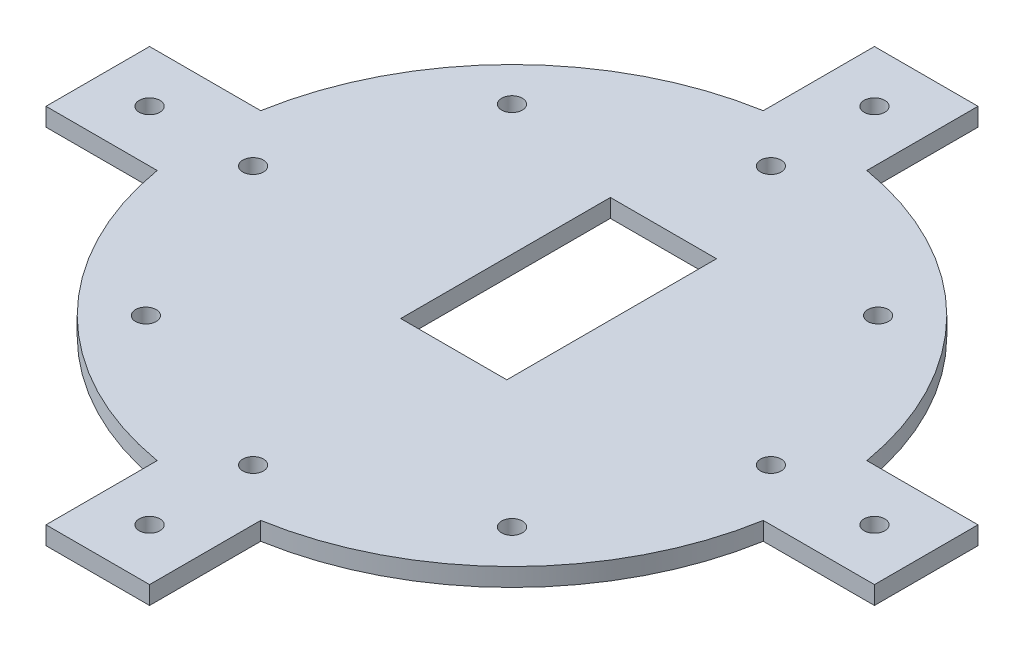
ISO-10303-21;
HEADER;
FILE_DESCRIPTION(('STEP AP214'),'2;1');
FILE_NAME('part.step','',(''),(''),'','','');
FILE_SCHEMA(('AUTOMOTIVE_DESIGN { 1 0 10303 214 1 1 1 1 }'));
ENDSEC;
DATA;
#1=APPLICATION_CONTEXT('core data for automotive mechanical design processes');
#2=APPLICATION_PROTOCOL_DEFINITION('international standard','automotive_design',2000,#1);
#3=PRODUCT_CONTEXT('',#1,'mechanical');
#4=PRODUCT('Part','Part','',(#3));
#5=PRODUCT_RELATED_PRODUCT_CATEGORY('part','',(#4));
#6=PRODUCT_DEFINITION_FORMATION('','',#4);
#7=PRODUCT_DEFINITION_CONTEXT('part definition',#1,'design');
#8=PRODUCT_DEFINITION('design','',#6,#7);
#9=PRODUCT_DEFINITION_SHAPE('','',#8);
#10=(LENGTH_UNIT() NAMED_UNIT(*) SI_UNIT(.MILLI.,.METRE.));
#11=(NAMED_UNIT(*) PLANE_ANGLE_UNIT() SI_UNIT($,.RADIAN.));
#12=(NAMED_UNIT(*) SI_UNIT($,.STERADIAN.) SOLID_ANGLE_UNIT());
#13=UNCERTAINTY_MEASURE_WITH_UNIT(LENGTH_MEASURE(1.E-05),#10,'distance_accuracy_value','');
#14=(GEOMETRIC_REPRESENTATION_CONTEXT(3) GLOBAL_UNCERTAINTY_ASSIGNED_CONTEXT((#13)) GLOBAL_UNIT_ASSIGNED_CONTEXT((#10,
#11,#12)) REPRESENTATION_CONTEXT('',''));
#15=CARTESIAN_POINT('',(0.,0.,0.));
#16=DIRECTION('',(0.,0.,1.));
#17=DIRECTION('',(1.,0.,0.));
#18=AXIS2_PLACEMENT_3D('',#15,#16,#17);
#19=CARTESIAN_POINT('',(-10.,3.5,-80.));
#20=DIRECTION('',(1.,0.,0.));
#21=DIRECTION('',(0.,0.,-1.));
#22=AXIS2_PLACEMENT_3D('',#19,#20,#21);
#23=PLANE('',#22);
#24=DIRECTION('',(0.,0.,1.));
#25=VECTOR('',#24,1.);
#26=CARTESIAN_POINT('',(-10.,0.,-80.));
#27=LINE('',#26,#25);
#28=CARTESIAN_POINT('',(-10.,0.,-80.));
#29=VERTEX_POINT('',#28);
#30=CARTESIAN_POINT('',(-9.99999999999997,0.,-58.5304135246494));
#31=VERTEX_POINT('',#30);
#32=EDGE_CURVE('E290',#29,#31,#27,.T.);
#33=ORIENTED_EDGE('',*,*,#32,.T.);
#34=DIRECTION('',(0.,-1.,0.));
#35=VECTOR('',#34,1.);
#36=CARTESIAN_POINT('',(-9.99999999999997,3.5,-58.5304135246494));
#37=LINE('',#36,#35);
#38=CARTESIAN_POINT('',(-9.99999999999997,3.5,-58.5304135246494));
#39=VERTEX_POINT('',#38);
#40=EDGE_CURVE('E11',#39,#31,#37,.T.);
#41=ORIENTED_EDGE('',*,*,#40,.F.);
#42=DIRECTION('',(0.,0.,1.));
#43=VECTOR('',#42,1.);
#44=CARTESIAN_POINT('',(-10.,3.5,-80.));
#45=LINE('',#44,#43);
#46=CARTESIAN_POINT('',(-10.,3.5,-80.));
#47=VERTEX_POINT('',#46);
#48=EDGE_CURVE('E291',#47,#39,#45,.T.);
#49=ORIENTED_EDGE('',*,*,#48,.F.);
#50=DIRECTION('',(0.,-1.,0.));
#51=VECTOR('',#50,1.);
#52=CARTESIAN_POINT('',(-10.,3.5,-80.));
#53=LINE('',#52,#51);
#54=EDGE_CURVE('E347',#47,#29,#53,.T.);
#55=ORIENTED_EDGE('',*,*,#54,.T.);
#56=EDGE_LOOP('',(#33,#41,#49,#55));
#57=FACE_BOUND('',#56,.T.);
#58=ADVANCED_FACE('F42',(#57),#23,.F.);
#59=CARTESIAN_POINT('',(0.,3.5,0.));
#60=DIRECTION('',(0.,-1.,0.));
#61=DIRECTION('',(0.,0.,-1.));
#62=AXIS2_PLACEMENT_3D('',#59,#60,#61);
#63=CYLINDRICAL_SURFACE('',#62,59.3785256415689);
#64=CARTESIAN_POINT('',(0.,0.,0.));
#65=DIRECTION('',(0.,1.,0.));
#66=DIRECTION('',(0.,0.,1.));
#67=AXIS2_PLACEMENT_3D('',#64,#65,#66);
#68=CIRCLE('',#67,59.3785256415689);
#69=CARTESIAN_POINT('',(-58.5304135246494,0.,-10.));
#70=VERTEX_POINT('',#69);
#71=EDGE_CURVE('E351',#31,#70,#68,.T.);
#72=ORIENTED_EDGE('',*,*,#71,.T.);
#73=DIRECTION('',(0.,-1.,0.));
#74=VECTOR('',#73,1.);
#75=CARTESIAN_POINT('',(-58.5304135246494,3.5,-10.));
#76=LINE('',#75,#74);
#77=CARTESIAN_POINT('',(-58.5304135246494,3.5,-10.));
#78=VERTEX_POINT('',#77);
#79=EDGE_CURVE('E50',#78,#70,#76,.T.);
#80=ORIENTED_EDGE('',*,*,#79,.F.);
#81=CARTESIAN_POINT('',(0.,3.5,0.));
#82=DIRECTION('',(0.,1.,0.));
#83=DIRECTION('',(0.,0.,1.));
#84=AXIS2_PLACEMENT_3D('',#81,#82,#83);
#85=CIRCLE('',#84,59.3785256415689);
#86=EDGE_CURVE('E295',#39,#78,#85,.T.);
#87=ORIENTED_EDGE('',*,*,#86,.F.);
#88=ORIENTED_EDGE('',*,*,#40,.T.);
#89=EDGE_LOOP('',(#72,#80,#87,#88));
#90=FACE_BOUND('',#89,.T.);
#91=ADVANCED_FACE('F457',(#90),#63,.T.);
#92=CARTESIAN_POINT('',(-80.,3.5,-10.));
#93=DIRECTION('',(0.,0.,-1.));
#94=DIRECTION('',(-1.,0.,0.));
#95=AXIS2_PLACEMENT_3D('',#92,#93,#94);
#96=PLANE('',#95);
#97=DIRECTION('',(1.,0.,0.));
#98=VECTOR('',#97,1.);
#99=CARTESIAN_POINT('',(-80.,0.,-10.));
#100=LINE('',#99,#98);
#101=CARTESIAN_POINT('',(-80.,0.,-10.));
#102=VERTEX_POINT('',#101);
#103=EDGE_CURVE('E355',#102,#70,#100,.T.);
#104=ORIENTED_EDGE('',*,*,#103,.F.);
#105=DIRECTION('',(0.,-1.,0.));
#106=VECTOR('',#105,1.);
#107=CARTESIAN_POINT('',(-80.,3.5,-10.));
#108=LINE('',#107,#106);
#109=CARTESIAN_POINT('',(-80.,3.5,-10.));
#110=VERTEX_POINT('',#109);
#111=EDGE_CURVE('E448',#110,#102,#108,.T.);
#112=ORIENTED_EDGE('',*,*,#111,.F.);
#113=DIRECTION('',(1.,0.,0.));
#114=VECTOR('',#113,1.);
#115=CARTESIAN_POINT('',(-80.,3.5,-10.));
#116=LINE('',#115,#114);
#117=EDGE_CURVE('E299',#110,#78,#116,.T.);
#118=ORIENTED_EDGE('',*,*,#117,.T.);
#119=ORIENTED_EDGE('',*,*,#79,.T.);
#120=EDGE_LOOP('',(#104,#112,#118,#119));
#121=FACE_BOUND('',#120,.T.);
#122=ADVANCED_FACE('F454',(#121),#96,.T.);
#123=CARTESIAN_POINT('',(-80.,3.5,10.));
#124=DIRECTION('',(-1.,0.,0.));
#125=DIRECTION('',(0.,0.,1.));
#126=AXIS2_PLACEMENT_3D('',#123,#124,#125);
#127=PLANE('',#126);
#128=DIRECTION('',(0.,0.,-1.));
#129=VECTOR('',#128,1.);
#130=CARTESIAN_POINT('',(-80.,0.,10.));
#131=LINE('',#130,#129);
#132=CARTESIAN_POINT('',(-80.,0.,10.));
#133=VERTEX_POINT('',#132);
#134=EDGE_CURVE('E359',#133,#102,#131,.T.);
#135=ORIENTED_EDGE('',*,*,#134,.F.);
#136=DIRECTION('',(0.,-1.,0.));
#137=VECTOR('',#136,1.);
#138=CARTESIAN_POINT('',(-80.,3.5,10.));
#139=LINE('',#138,#137);
#140=CARTESIAN_POINT('',(-80.,3.5,10.));
#141=VERTEX_POINT('',#140);
#142=EDGE_CURVE('E445',#141,#133,#139,.T.);
#143=ORIENTED_EDGE('',*,*,#142,.F.);
#144=DIRECTION('',(0.,0.,-1.));
#145=VECTOR('',#144,1.);
#146=CARTESIAN_POINT('',(-80.,3.5,10.));
#147=LINE('',#146,#145);
#148=EDGE_CURVE('E303',#141,#110,#147,.T.);
#149=ORIENTED_EDGE('',*,*,#148,.T.);
#150=ORIENTED_EDGE('',*,*,#111,.T.);
#151=EDGE_LOOP('',(#135,#143,#149,#150));
#152=FACE_BOUND('',#151,.T.);
#153=ADVANCED_FACE('F465',(#152),#127,.T.);
#154=CARTESIAN_POINT('',(-80.,3.5,10.));
#155=DIRECTION('',(0.,0.,-1.));
#156=DIRECTION('',(-1.,0.,0.));
#157=AXIS2_PLACEMENT_3D('',#154,#155,#156);
#158=PLANE('',#157);
#159=DIRECTION('',(1.,0.,0.));
#160=VECTOR('',#159,1.);
#161=CARTESIAN_POINT('',(-80.,0.,10.));
#162=LINE('',#161,#160);
#163=CARTESIAN_POINT('',(-58.5304135246494,0.,10.));
#164=VERTEX_POINT('',#163);
#165=EDGE_CURVE('E363',#133,#164,#162,.T.);
#166=ORIENTED_EDGE('',*,*,#165,.T.);
#167=DIRECTION('',(0.,-1.,0.));
#168=VECTOR('',#167,1.);
#169=CARTESIAN_POINT('',(-58.5304135246494,3.5,10.));
#170=LINE('',#169,#168);
#171=CARTESIAN_POINT('',(-58.5304135246494,3.5,10.));
#172=VERTEX_POINT('',#171);
#173=EDGE_CURVE('E441',#172,#164,#170,.T.);
#174=ORIENTED_EDGE('',*,*,#173,.F.);
#175=DIRECTION('',(1.,0.,0.));
#176=VECTOR('',#175,1.);
#177=CARTESIAN_POINT('',(-80.,3.5,10.));
#178=LINE('',#177,#176);
#179=EDGE_CURVE('E307',#141,#172,#178,.T.);
#180=ORIENTED_EDGE('',*,*,#179,.F.);
#181=ORIENTED_EDGE('',*,*,#142,.T.);
#182=EDGE_LOOP('',(#166,#174,#180,#181));
#183=FACE_BOUND('',#182,.T.);
#184=ADVANCED_FACE('F523',(#183),#158,.F.);
#185=CARTESIAN_POINT('',(0.,3.5,0.));
#186=DIRECTION('',(0.,-1.,0.));
#187=DIRECTION('',(0.,0.,-1.));
#188=AXIS2_PLACEMENT_3D('',#185,#186,#187);
#189=CYLINDRICAL_SURFACE('',#188,59.3785256415689);
#190=CARTESIAN_POINT('',(0.,0.,0.));
#191=DIRECTION('',(0.,1.,0.));
#192=DIRECTION('',(0.,0.,1.));
#193=AXIS2_PLACEMENT_3D('',#190,#191,#192);
#194=CIRCLE('',#193,59.3785256415689);
#195=CARTESIAN_POINT('',(-10.,0.,58.5304135246494));
#196=VERTEX_POINT('',#195);
#197=EDGE_CURVE('E366',#164,#196,#194,.T.);
#198=ORIENTED_EDGE('',*,*,#197,.T.);
#199=DIRECTION('',(0.,-1.,0.));
#200=VECTOR('',#199,1.);
#201=CARTESIAN_POINT('',(-10.,3.5,58.5304135246494));
#202=LINE('',#201,#200);
#203=CARTESIAN_POINT('',(-10.,3.5,58.5304135246494));
#204=VERTEX_POINT('',#203);
#205=EDGE_CURVE('E437',#204,#196,#202,.T.);
#206=ORIENTED_EDGE('',*,*,#205,.F.);
#207=CARTESIAN_POINT('',(0.,3.5,0.));
#208=DIRECTION('',(0.,1.,0.));
#209=DIRECTION('',(0.,0.,1.));
#210=AXIS2_PLACEMENT_3D('',#207,#208,#209);
#211=CIRCLE('',#210,59.3785256415689);
#212=EDGE_CURVE('E310',#172,#204,#211,.T.);
#213=ORIENTED_EDGE('',*,*,#212,.F.);
#214=ORIENTED_EDGE('',*,*,#173,.T.);
#215=EDGE_LOOP('',(#198,#206,#213,#214));
#216=FACE_BOUND('',#215,.T.);
#217=ADVANCED_FACE('F520',(#216),#189,.T.);
#218=CARTESIAN_POINT('',(-9.99999999999999,3.5,58.5304135246494));
#219=DIRECTION('',(1.,0.,0.));
#220=DIRECTION('',(0.,0.,-1.));
#221=AXIS2_PLACEMENT_3D('',#218,#219,#220);
#222=PLANE('',#221);
#223=DIRECTION('',(0.,0.,1.));
#224=VECTOR('',#223,1.);
#225=CARTESIAN_POINT('',(-9.99999999999999,0.,58.5304135246494));
#226=LINE('',#225,#224);
#227=CARTESIAN_POINT('',(-9.99999999999999,0.,80.));
#228=VERTEX_POINT('',#227);
#229=EDGE_CURVE('E369',#196,#228,#226,.T.);
#230=ORIENTED_EDGE('',*,*,#229,.T.);
#231=DIRECTION('',(0.,-1.,0.));
#232=VECTOR('',#231,1.);
#233=CARTESIAN_POINT('',(-9.99999999999999,3.5,80.));
#234=LINE('',#233,#232);
#235=CARTESIAN_POINT('',(-9.99999999999999,3.5,80.));
#236=VERTEX_POINT('',#235);
#237=EDGE_CURVE('E433',#236,#228,#234,.T.);
#238=ORIENTED_EDGE('',*,*,#237,.F.);
#239=DIRECTION('',(0.,0.,1.));
#240=VECTOR('',#239,1.);
#241=CARTESIAN_POINT('',(-9.99999999999999,3.5,58.5304135246494));
#242=LINE('',#241,#240);
#243=EDGE_CURVE('E313',#204,#236,#242,.T.);
#244=ORIENTED_EDGE('',*,*,#243,.F.);
#245=ORIENTED_EDGE('',*,*,#205,.T.);
#246=EDGE_LOOP('',(#230,#238,#244,#245));
#247=FACE_BOUND('',#246,.T.);
#248=ADVANCED_FACE('F516',(#247),#222,.F.);
#249=CARTESIAN_POINT('',(-9.99999999999999,3.5,80.));
#250=DIRECTION('',(0.,0.,-1.));
#251=DIRECTION('',(-1.,0.,0.));
#252=AXIS2_PLACEMENT_3D('',#249,#250,#251);
#253=PLANE('',#252);
#254=DIRECTION('',(1.,0.,0.));
#255=VECTOR('',#254,1.);
#256=CARTESIAN_POINT('',(-9.99999999999999,0.,80.));
#257=LINE('',#256,#255);
#258=CARTESIAN_POINT('',(10.,0.,80.));
#259=VERTEX_POINT('',#258);
#260=EDGE_CURVE('E372',#228,#259,#257,.T.);
#261=ORIENTED_EDGE('',*,*,#260,.T.);
#262=DIRECTION('',(0.,-1.,0.));
#263=VECTOR('',#262,1.);
#264=CARTESIAN_POINT('',(10.,3.5,80.));
#265=LINE('',#264,#263);
#266=CARTESIAN_POINT('',(10.,3.5,80.));
#267=VERTEX_POINT('',#266);
#268=EDGE_CURVE('E430',#267,#259,#265,.T.);
#269=ORIENTED_EDGE('',*,*,#268,.F.);
#270=DIRECTION('',(1.,0.,0.));
#271=VECTOR('',#270,1.);
#272=CARTESIAN_POINT('',(-9.99999999999999,3.5,80.));
#273=LINE('',#272,#271);
#274=EDGE_CURVE('E316',#236,#267,#273,.T.);
#275=ORIENTED_EDGE('',*,*,#274,.F.);
#276=ORIENTED_EDGE('',*,*,#237,.T.);
#277=EDGE_LOOP('',(#261,#269,#275,#276));
#278=FACE_BOUND('',#277,.T.);
#279=ADVANCED_FACE('F511',(#278),#253,.F.);
#280=CARTESIAN_POINT('',(10.,3.5,58.5304135246494));
#281=DIRECTION('',(1.,0.,0.));
#282=DIRECTION('',(0.,0.,-1.));
#283=AXIS2_PLACEMENT_3D('',#280,#281,#282);
#284=PLANE('',#283);
#285=DIRECTION('',(0.,0.,1.));
#286=VECTOR('',#285,1.);
#287=CARTESIAN_POINT('',(10.,0.,58.5304135246494));
#288=LINE('',#287,#286);
#289=CARTESIAN_POINT('',(10.,0.,58.5304135246494));
#290=VERTEX_POINT('',#289);
#291=EDGE_CURVE('E376',#290,#259,#288,.T.);
#292=ORIENTED_EDGE('',*,*,#291,.F.);
#293=DIRECTION('',(0.,-1.,0.));
#294=VECTOR('',#293,1.);
#295=CARTESIAN_POINT('',(10.,3.5,58.5304135246494));
#296=LINE('',#295,#294);
#297=CARTESIAN_POINT('',(10.,3.5,58.5304135246494));
#298=VERTEX_POINT('',#297);
#299=EDGE_CURVE('E427',#298,#290,#296,.T.);
#300=ORIENTED_EDGE('',*,*,#299,.F.);
#301=DIRECTION('',(0.,0.,1.));
#302=VECTOR('',#301,1.);
#303=CARTESIAN_POINT('',(10.,3.5,58.5304135246494));
#304=LINE('',#303,#302);
#305=EDGE_CURVE('E319',#298,#267,#304,.T.);
#306=ORIENTED_EDGE('',*,*,#305,.T.);
#307=ORIENTED_EDGE('',*,*,#268,.T.);
#308=EDGE_LOOP('',(#292,#300,#306,#307));
#309=FACE_BOUND('',#308,.T.);
#310=ADVANCED_FACE('F506',(#309),#284,.T.);
#311=CARTESIAN_POINT('',(0.,3.5,0.));
#312=DIRECTION('',(0.,-1.,0.));
#313=DIRECTION('',(0.,0.,-1.));
#314=AXIS2_PLACEMENT_3D('',#311,#312,#313);
#315=CYLINDRICAL_SURFACE('',#314,59.3785256415689);
#316=CARTESIAN_POINT('',(0.,0.,0.));
#317=DIRECTION('',(0.,1.,0.));
#318=DIRECTION('',(0.,0.,1.));
#319=AXIS2_PLACEMENT_3D('',#316,#317,#318);
#320=CIRCLE('',#319,59.3785256415689);
#321=CARTESIAN_POINT('',(58.5304135246494,0.,10.));
#322=VERTEX_POINT('',#321);
#323=EDGE_CURVE('E380',#290,#322,#320,.T.);
#324=ORIENTED_EDGE('',*,*,#323,.T.);
#325=DIRECTION('',(0.,-1.,0.));
#326=VECTOR('',#325,1.);
#327=CARTESIAN_POINT('',(58.5304135246494,3.5,10.));
#328=LINE('',#327,#326);
#329=CARTESIAN_POINT('',(58.5304135246494,3.5,10.));
#330=VERTEX_POINT('',#329);
#331=EDGE_CURVE('E423',#330,#322,#328,.T.);
#332=ORIENTED_EDGE('',*,*,#331,.F.);
#333=CARTESIAN_POINT('',(0.,3.5,0.));
#334=DIRECTION('',(0.,1.,0.));
#335=DIRECTION('',(0.,0.,1.));
#336=AXIS2_PLACEMENT_3D('',#333,#334,#335);
#337=CIRCLE('',#336,59.3785256415689);
#338=EDGE_CURVE('E323',#298,#330,#337,.T.);
#339=ORIENTED_EDGE('',*,*,#338,.F.);
#340=ORIENTED_EDGE('',*,*,#299,.T.);
#341=EDGE_LOOP('',(#324,#332,#339,#340));
#342=FACE_BOUND('',#341,.T.);
#343=ADVANCED_FACE('F503',(#342),#315,.T.);
#344=CARTESIAN_POINT('',(58.5304135246494,3.5,10.));
#345=DIRECTION('',(0.,0.,-1.));
#346=DIRECTION('',(-1.,0.,0.));
#347=AXIS2_PLACEMENT_3D('',#344,#345,#346);
#348=PLANE('',#347);
#349=DIRECTION('',(1.,0.,0.));
#350=VECTOR('',#349,1.);
#351=CARTESIAN_POINT('',(58.5304135246494,0.,10.));
#352=LINE('',#351,#350);
#353=CARTESIAN_POINT('',(80.,0.,10.));
#354=VERTEX_POINT('',#353);
#355=EDGE_CURVE('E383',#322,#354,#352,.T.);
#356=ORIENTED_EDGE('',*,*,#355,.T.);
#357=DIRECTION('',(0.,-1.,0.));
#358=VECTOR('',#357,1.);
#359=CARTESIAN_POINT('',(80.,3.5,10.));
#360=LINE('',#359,#358);
#361=CARTESIAN_POINT('',(80.,3.5,10.));
#362=VERTEX_POINT('',#361);
#363=EDGE_CURVE('E419',#362,#354,#360,.T.);
#364=ORIENTED_EDGE('',*,*,#363,.F.);
#365=DIRECTION('',(1.,0.,0.));
#366=VECTOR('',#365,1.);
#367=CARTESIAN_POINT('',(58.5304135246494,3.5,10.));
#368=LINE('',#367,#366);
#369=EDGE_CURVE('E326',#330,#362,#368,.T.);
#370=ORIENTED_EDGE('',*,*,#369,.F.);
#371=ORIENTED_EDGE('',*,*,#331,.T.);
#372=EDGE_LOOP('',(#356,#364,#370,#371));
#373=FACE_BOUND('',#372,.T.);
#374=ADVANCED_FACE('F498',(#373),#348,.F.);
#375=CARTESIAN_POINT('',(80.,3.5,10.));
#376=DIRECTION('',(-1.,0.,0.));
#377=DIRECTION('',(0.,0.,1.));
#378=AXIS2_PLACEMENT_3D('',#375,#376,#377);
#379=PLANE('',#378);
#380=DIRECTION('',(0.,0.,-1.));
#381=VECTOR('',#380,1.);
#382=CARTESIAN_POINT('',(80.,0.,10.));
#383=LINE('',#382,#381);
#384=CARTESIAN_POINT('',(80.,0.,-10.));
#385=VERTEX_POINT('',#384);
#386=EDGE_CURVE('E386',#354,#385,#383,.T.);
#387=ORIENTED_EDGE('',*,*,#386,.T.);
#388=DIRECTION('',(0.,-1.,0.));
#389=VECTOR('',#388,1.);
#390=CARTESIAN_POINT('',(80.,3.5,-10.));
#391=LINE('',#390,#389);
#392=CARTESIAN_POINT('',(80.,3.5,-10.));
#393=VERTEX_POINT('',#392);
#394=EDGE_CURVE('E416',#393,#385,#391,.T.);
#395=ORIENTED_EDGE('',*,*,#394,.F.);
#396=DIRECTION('',(0.,0.,-1.));
#397=VECTOR('',#396,1.);
#398=CARTESIAN_POINT('',(80.,3.5,10.));
#399=LINE('',#398,#397);
#400=EDGE_CURVE('E329',#362,#393,#399,.T.);
#401=ORIENTED_EDGE('',*,*,#400,.F.);
#402=ORIENTED_EDGE('',*,*,#363,.T.);
#403=EDGE_LOOP('',(#387,#395,#401,#402));
#404=FACE_BOUND('',#403,.T.);
#405=ADVANCED_FACE('F492',(#404),#379,.F.);
#406=CARTESIAN_POINT('',(58.5304135246494,3.5,-10.));
#407=DIRECTION('',(0.,0.,-1.));
#408=DIRECTION('',(-1.,0.,0.));
#409=AXIS2_PLACEMENT_3D('',#406,#407,#408);
#410=PLANE('',#409);
#411=DIRECTION('',(1.,0.,0.));
#412=VECTOR('',#411,1.);
#413=CARTESIAN_POINT('',(58.5304135246494,0.,-10.));
#414=LINE('',#413,#412);
#415=CARTESIAN_POINT('',(58.5304135246494,0.,-10.));
#416=VERTEX_POINT('',#415);
#417=EDGE_CURVE('E390',#416,#385,#414,.T.);
#418=ORIENTED_EDGE('',*,*,#417,.F.);
#419=DIRECTION('',(0.,-1.,0.));
#420=VECTOR('',#419,1.);
#421=CARTESIAN_POINT('',(58.5304135246494,3.5,-10.));
#422=LINE('',#421,#420);
#423=CARTESIAN_POINT('',(58.5304135246494,3.5,-10.));
#424=VERTEX_POINT('',#423);
#425=EDGE_CURVE('E413',#424,#416,#422,.T.);
#426=ORIENTED_EDGE('',*,*,#425,.F.);
#427=DIRECTION('',(1.,0.,0.));
#428=VECTOR('',#427,1.);
#429=CARTESIAN_POINT('',(58.5304135246494,3.5,-10.));
#430=LINE('',#429,#428);
#431=EDGE_CURVE('E332',#424,#393,#430,.T.);
#432=ORIENTED_EDGE('',*,*,#431,.T.);
#433=ORIENTED_EDGE('',*,*,#394,.T.);
#434=EDGE_LOOP('',(#418,#426,#432,#433));
#435=FACE_BOUND('',#434,.T.);
#436=ADVANCED_FACE('F486',(#435),#410,.T.);
#437=CARTESIAN_POINT('',(0.,3.5,0.));
#438=DIRECTION('',(0.,-1.,0.));
#439=DIRECTION('',(0.,0.,-1.));
#440=AXIS2_PLACEMENT_3D('',#437,#438,#439);
#441=CYLINDRICAL_SURFACE('',#440,59.3785256415689);
#442=CARTESIAN_POINT('',(0.,0.,0.));
#443=DIRECTION('',(0.,1.,0.));
#444=DIRECTION('',(0.,0.,1.));
#445=AXIS2_PLACEMENT_3D('',#442,#443,#444);
#446=CIRCLE('',#445,59.3785256415689);
#447=CARTESIAN_POINT('',(10.,0.,-58.5304135246494));
#448=VERTEX_POINT('',#447);
#449=EDGE_CURVE('E394',#416,#448,#446,.T.);
#450=ORIENTED_EDGE('',*,*,#449,.T.);
#451=DIRECTION('',(0.,-1.,0.));
#452=VECTOR('',#451,1.);
#453=CARTESIAN_POINT('',(10.,3.5,-58.5304135246494));
#454=LINE('',#453,#452);
#455=CARTESIAN_POINT('',(10.,3.5,-58.5304135246494));
#456=VERTEX_POINT('',#455);
#457=EDGE_CURVE('E410',#456,#448,#454,.T.);
#458=ORIENTED_EDGE('',*,*,#457,.F.);
#459=CARTESIAN_POINT('',(0.,3.5,0.));
#460=DIRECTION('',(0.,1.,0.));
#461=DIRECTION('',(0.,0.,1.));
#462=AXIS2_PLACEMENT_3D('',#459,#460,#461);
#463=CIRCLE('',#462,59.3785256415689);
#464=EDGE_CURVE('E336',#424,#456,#463,.T.);
#465=ORIENTED_EDGE('',*,*,#464,.F.);
#466=ORIENTED_EDGE('',*,*,#425,.T.);
#467=EDGE_LOOP('',(#450,#458,#465,#466));
#468=FACE_BOUND('',#467,.T.);
#469=ADVANCED_FACE('F524',(#468),#441,.T.);
#470=CARTESIAN_POINT('',(9.99999999999999,3.5,-80.));
#471=DIRECTION('',(1.,0.,0.));
#472=DIRECTION('',(0.,0.,-1.));
#473=AXIS2_PLACEMENT_3D('',#470,#471,#472);
#474=PLANE('',#473);
#475=DIRECTION('',(0.,0.,1.));
#476=VECTOR('',#475,1.);
#477=CARTESIAN_POINT('',(9.99999999999999,0.,-80.));
#478=LINE('',#477,#476);
#479=CARTESIAN_POINT('',(9.99999999999999,0.,-80.));
#480=VERTEX_POINT('',#479);
#481=EDGE_CURVE('E398',#480,#448,#478,.T.);
#482=ORIENTED_EDGE('',*,*,#481,.F.);
#483=DIRECTION('',(0.,-1.,0.));
#484=VECTOR('',#483,1.);
#485=CARTESIAN_POINT('',(9.99999999999999,3.5,-80.));
#486=LINE('',#485,#484);
#487=CARTESIAN_POINT('',(9.99999999999999,3.5,-80.));
#488=VERTEX_POINT('',#487);
#489=EDGE_CURVE('E407',#488,#480,#486,.T.);
#490=ORIENTED_EDGE('',*,*,#489,.F.);
#491=DIRECTION('',(0.,0.,1.));
#492=VECTOR('',#491,1.);
#493=CARTESIAN_POINT('',(9.99999999999999,3.5,-80.));
#494=LINE('',#493,#492);
#495=EDGE_CURVE('E339',#488,#456,#494,.T.);
#496=ORIENTED_EDGE('',*,*,#495,.T.);
#497=ORIENTED_EDGE('',*,*,#457,.T.);
#498=EDGE_LOOP('',(#482,#490,#496,#497));
#499=FACE_BOUND('',#498,.T.);
#500=ADVANCED_FACE('F479',(#499),#474,.T.);
#501=CARTESIAN_POINT('',(-10.,3.5,-80.));
#502=DIRECTION('',(0.,0.,-1.));
#503=DIRECTION('',(-1.,0.,0.));
#504=AXIS2_PLACEMENT_3D('',#501,#502,#503);
#505=PLANE('',#504);
#506=DIRECTION('',(1.,0.,0.));
#507=VECTOR('',#506,1.);
#508=CARTESIAN_POINT('',(-10.,0.,-80.));
#509=LINE('',#508,#507);
#510=EDGE_CURVE('E296',#29,#480,#509,.T.);
#511=ORIENTED_EDGE('',*,*,#510,.F.);
#512=ORIENTED_EDGE('',*,*,#54,.F.);
#513=DIRECTION('',(1.,0.,0.));
#514=VECTOR('',#513,1.);
#515=CARTESIAN_POINT('',(-10.,3.5,-80.));
#516=LINE('',#515,#514);
#517=EDGE_CURVE('E343',#47,#488,#516,.T.);
#518=ORIENTED_EDGE('',*,*,#517,.T.);
#519=ORIENTED_EDGE('',*,*,#489,.T.);
#520=EDGE_LOOP('',(#511,#512,#518,#519));
#521=FACE_BOUND('',#520,.T.);
#522=ADVANCED_FACE('F476',(#521),#505,.T.);
#523=CARTESIAN_POINT('',(0.,3.5,0.));
#524=DIRECTION('',(0.,1.,0.));
#525=DIRECTION('',(0.,0.,1.));
#526=AXIS2_PLACEMENT_3D('',#523,#524,#525);
#527=PLANE('',#526);
#528=CARTESIAN_POINT('',(0.,3.5,-70.));
#529=DIRECTION('',(0.,1.,0.));
#530=DIRECTION('',(0.,0.,1.));
#531=AXIS2_PLACEMENT_3D('',#528,#529,#530);
#532=CIRCLE('',#531,2.00000000000334);
#533=CARTESIAN_POINT('',(0.,3.5,-67.9999999999967));
#534=VERTEX_POINT('',#533);
#535=EDGE_CURVE('E895',#534,#534,#532,.T.);
#536=ORIENTED_EDGE('',*,*,#535,.F.);
#537=EDGE_LOOP('',(#536));
#538=FACE_BOUND('',#537,.T.);
#539=CARTESIAN_POINT('',(70.0000000000015,3.5,-1.55400916767862E-12));
#540=DIRECTION('',(0.,1.,0.));
#541=DIRECTION('',(0.,0.,1.));
#542=AXIS2_PLACEMENT_3D('',#539,#540,#541);
#543=CIRCLE('',#542,2.00000000000333);
#544=CARTESIAN_POINT('',(70.0000000000015,3.5,2.00000000000178));
#545=VERTEX_POINT('',#544);
#546=EDGE_CURVE('E903',#545,#545,#543,.T.);
#547=ORIENTED_EDGE('',*,*,#546,.F.);
#548=EDGE_LOOP('',(#547));
#549=FACE_BOUND('',#548,.T.);
#550=CARTESIAN_POINT('',(3.10801833535723E-12,3.5,70.));
#551=DIRECTION('',(0.,1.,0.));
#552=DIRECTION('',(0.,0.,1.));
#553=AXIS2_PLACEMENT_3D('',#550,#551,#552);
#554=CIRCLE('',#553,2.00000000000334);
#555=CARTESIAN_POINT('',(3.10801833535723E-12,3.5,72.0000000000033));
#556=VERTEX_POINT('',#555);
#557=EDGE_CURVE('E910',#556,#556,#554,.T.);
#558=ORIENTED_EDGE('',*,*,#557,.F.);
#559=EDGE_LOOP('',(#558));
#560=FACE_BOUND('',#559,.T.);
#561=CARTESIAN_POINT('',(-69.9999999999985,3.5,1.56258169527265E-12));
#562=DIRECTION('',(0.,1.,0.));
#563=DIRECTION('',(0.,0.,1.));
#564=AXIS2_PLACEMENT_3D('',#561,#562,#563);
#565=CIRCLE('',#564,2.00000000000333);
#566=CARTESIAN_POINT('',(-69.9999999999985,3.5,2.0000000000049));
#567=VERTEX_POINT('',#566);
#568=EDGE_CURVE('E918',#567,#567,#565,.T.);
#569=ORIENTED_EDGE('',*,*,#568,.F.);
#570=EDGE_LOOP('',(#569));
#571=FACE_BOUND('',#570,.T.);
#572=DIRECTION('',(0.,0.,1.));
#573=VECTOR('',#572,1.);
#574=CARTESIAN_POINT('',(-10.25,3.5,-29.25));
#575=LINE('',#574,#573);
#576=CARTESIAN_POINT('',(-10.25,3.5,-29.25));
#577=VERTEX_POINT('',#576);
#578=CARTESIAN_POINT('',(-10.25,3.5,11.25));
#579=VERTEX_POINT('',#578);
#580=EDGE_CURVE('E57',#577,#579,#575,.T.);
#581=ORIENTED_EDGE('',*,*,#580,.F.);
#582=DIRECTION('',(-1.,0.,0.));
#583=VECTOR('',#582,1.);
#584=CARTESIAN_POINT('',(10.25,3.5,-29.25));
#585=LINE('',#584,#583);
#586=CARTESIAN_POINT('',(10.25,3.5,-29.25));
#587=VERTEX_POINT('',#586);
#588=EDGE_CURVE('E188',#587,#577,#585,.T.);
#589=ORIENTED_EDGE('',*,*,#588,.F.);
#590=DIRECTION('',(0.,0.,-1.));
#591=VECTOR('',#590,1.);
#592=CARTESIAN_POINT('',(10.25,3.5,-29.25));
#593=LINE('',#592,#591);
#594=CARTESIAN_POINT('',(10.25,3.5,11.25));
#595=VERTEX_POINT('',#594);
#596=EDGE_CURVE('E213',#595,#587,#593,.T.);
#597=ORIENTED_EDGE('',*,*,#596,.F.);
#598=DIRECTION('',(1.,0.,0.));
#599=VECTOR('',#598,1.);
#600=CARTESIAN_POINT('',(10.25,3.5,11.25));
#601=LINE('',#600,#599);
#602=EDGE_CURVE('E206',#579,#595,#601,.T.);
#603=ORIENTED_EDGE('',*,*,#602,.F.);
#604=EDGE_LOOP('',(#581,#589,#597,#603));
#605=FACE_BOUND('',#604,.T.);
#606=CARTESIAN_POINT('',(-50.,3.5,1.74574066942157E-13));
#607=DIRECTION('',(0.,1.,0.));
#608=DIRECTION('',(1.,0.,0.));
#609=AXIS2_PLACEMENT_3D('',#606,#607,#608);
#610=CIRCLE('',#609,2.);
#611=CARTESIAN_POINT('',(-48.,3.5,1.6759110426447E-13));
#612=VERTEX_POINT('',#611);
#613=EDGE_CURVE('E243',#612,#612,#610,.T.);
#614=ORIENTED_EDGE('',*,*,#613,.F.);
#615=EDGE_LOOP('',(#614));
#616=FACE_BOUND('',#615,.T.);
#617=CARTESIAN_POINT('',(-35.3553390593272,3.5,35.3553390593276));
#618=DIRECTION('',(0.,1.,0.));
#619=DIRECTION('',(0.707106781186544,0.,-0.707106781186551));
#620=AXIS2_PLACEMENT_3D('',#617,#618,#619);
#621=CIRCLE('',#620,2.);
#622=CARTESIAN_POINT('',(-33.9411254969541,3.5,33.9411254969545));
#623=VERTEX_POINT('',#622);
#624=EDGE_CURVE('E253',#623,#623,#621,.T.);
#625=ORIENTED_EDGE('',*,*,#624,.F.);
#626=EDGE_LOOP('',(#625));
#627=FACE_BOUND('',#626,.T.);
#628=CARTESIAN_POINT('',(0.,3.5,50.));
#629=DIRECTION('',(0.,1.,0.));
#630=DIRECTION('',(0.,0.,-1.));
#631=AXIS2_PLACEMENT_3D('',#628,#629,#630);
#632=CIRCLE('',#631,2.);
#633=CARTESIAN_POINT('',(0.,3.5,48.));
#634=VERTEX_POINT('',#633);
#635=EDGE_CURVE('E261',#634,#634,#632,.T.);
#636=ORIENTED_EDGE('',*,*,#635,.F.);
#637=EDGE_LOOP('',(#636));
#638=FACE_BOUND('',#637,.T.);
#639=CARTESIAN_POINT('',(35.3553390593277,3.5,35.3553390593271));
#640=DIRECTION('',(0.,1.,0.));
#641=DIRECTION('',(-0.707106781186554,0.,-0.707106781186541));
#642=AXIS2_PLACEMENT_3D('',#639,#640,#641);
#643=CIRCLE('',#642,2.);
#644=CARTESIAN_POINT('',(33.9411254969546,3.5,33.941125496954));
#645=VERTEX_POINT('',#644);
#646=EDGE_CURVE('E236',#645,#645,#643,.T.);
#647=ORIENTED_EDGE('',*,*,#646,.F.);
#648=EDGE_LOOP('',(#647));
#649=FACE_BOUND('',#648,.T.);
#650=CARTESIAN_POINT('',(50.,3.5,-5.2372220082647E-13));
#651=DIRECTION('',(0.,1.,0.));
#652=DIRECTION('',(-1.,0.,0.));
#653=AXIS2_PLACEMENT_3D('',#650,#651,#652);
#654=CIRCLE('',#653,2.);
#655=CARTESIAN_POINT('',(48.,3.5,-5.02773312793411E-13));
#656=VERTEX_POINT('',#655);
#657=EDGE_CURVE('E227',#656,#656,#654,.T.);
#658=ORIENTED_EDGE('',*,*,#657,.F.);
#659=EDGE_LOOP('',(#658));
#660=FACE_BOUND('',#659,.T.);
#661=CARTESIAN_POINT('',(35.3553390593269,3.5,-35.3553390593278));
#662=DIRECTION('',(0.,1.,0.));
#663=DIRECTION('',(-0.707106781186539,0.,0.707106781186556));
#664=AXIS2_PLACEMENT_3D('',#661,#662,#663);
#665=CIRCLE('',#664,2.);
#666=CARTESIAN_POINT('',(33.9411254969539,3.5,-33.9411254969547));
#667=VERTEX_POINT('',#666);
#668=EDGE_CURVE('E195',#667,#667,#665,.T.);
#669=ORIENTED_EDGE('',*,*,#668,.F.);
#670=EDGE_LOOP('',(#669));
#671=FACE_BOUND('',#670,.T.);
#672=CARTESIAN_POINT('',(-35.3553390593274,3.5,-35.3553390593273));
#673=DIRECTION('',(0.,1.,0.));
#674=DIRECTION('',(0.707106781186549,0.,0.707106781186546));
#675=AXIS2_PLACEMENT_3D('',#672,#673,#674);
#676=CIRCLE('',#675,2.);
#677=CARTESIAN_POINT('',(-33.9411254969543,3.5,-33.9411254969542));
#678=VERTEX_POINT('',#677);
#679=EDGE_CURVE('E252',#678,#678,#676,.T.);
#680=ORIENTED_EDGE('',*,*,#679,.F.);
#681=EDGE_LOOP('',(#680));
#682=FACE_BOUND('',#681,.T.);
#683=CARTESIAN_POINT('',(0.,3.5,-50.));
#684=DIRECTION('',(0.,1.,0.));
#685=DIRECTION('',(0.,0.,1.));
#686=AXIS2_PLACEMENT_3D('',#683,#684,#685);
#687=CIRCLE('',#686,2.);
#688=CARTESIAN_POINT('',(0.,3.5,-48.));
#689=VERTEX_POINT('',#688);
#690=EDGE_CURVE('E282',#689,#689,#687,.T.);
#691=ORIENTED_EDGE('',*,*,#690,.F.);
#692=EDGE_LOOP('',(#691));
#693=FACE_BOUND('',#692,.T.);
#694=ORIENTED_EDGE('',*,*,#48,.T.);
#695=ORIENTED_EDGE('',*,*,#86,.T.);
#696=ORIENTED_EDGE('',*,*,#117,.F.);
#697=ORIENTED_EDGE('',*,*,#148,.F.);
#698=ORIENTED_EDGE('',*,*,#179,.T.);
#699=ORIENTED_EDGE('',*,*,#212,.T.);
#700=ORIENTED_EDGE('',*,*,#243,.T.);
#701=ORIENTED_EDGE('',*,*,#274,.T.);
#702=ORIENTED_EDGE('',*,*,#305,.F.);
#703=ORIENTED_EDGE('',*,*,#338,.T.);
#704=ORIENTED_EDGE('',*,*,#369,.T.);
#705=ORIENTED_EDGE('',*,*,#400,.T.);
#706=ORIENTED_EDGE('',*,*,#431,.F.);
#707=ORIENTED_EDGE('',*,*,#464,.T.);
#708=ORIENTED_EDGE('',*,*,#495,.F.);
#709=ORIENTED_EDGE('',*,*,#517,.F.);
#710=EDGE_LOOP('',(#694,#695,#696,#697,#698,#699,#700,#701,#702,#703,#704,#705,#706,#707,#708,#709));
#711=FACE_BOUND('',#710,.T.);
#712=ADVANCED_FACE('F469',(#538,#549,#560,#571,#605,#616,#627,#638,#649,#660,#671,#682,#693,
#711),#527,.T.);
#713=CARTESIAN_POINT('',(0.,0.,0.));
#714=DIRECTION('',(0.,1.,0.));
#715=DIRECTION('',(0.,0.,1.));
#716=AXIS2_PLACEMENT_3D('',#713,#714,#715);
#717=PLANE('',#716);
#718=CARTESIAN_POINT('',(0.,0.,-70.));
#719=DIRECTION('',(0.,1.,0.));
#720=DIRECTION('',(0.,0.,1.));
#721=AXIS2_PLACEMENT_3D('',#718,#719,#720);
#722=CIRCLE('',#721,2.00000000000334);
#723=CARTESIAN_POINT('',(0.,0.,-67.9999999999967));
#724=VERTEX_POINT('',#723);
#725=EDGE_CURVE('E898',#724,#724,#722,.F.);
#726=ORIENTED_EDGE('',*,*,#725,.F.);
#727=EDGE_LOOP('',(#726));
#728=FACE_BOUND('',#727,.T.);
#729=CARTESIAN_POINT('',(70.0000000000015,0.,-1.55400916767862E-12));
#730=DIRECTION('',(0.,1.,0.));
#731=DIRECTION('',(0.,0.,1.));
#732=AXIS2_PLACEMENT_3D('',#729,#730,#731);
#733=CIRCLE('',#732,2.00000000000333);
#734=CARTESIAN_POINT('',(70.0000000000015,0.,2.00000000000178));
#735=VERTEX_POINT('',#734);
#736=EDGE_CURVE('E906',#735,#735,#733,.F.);
#737=ORIENTED_EDGE('',*,*,#736,.F.);
#738=EDGE_LOOP('',(#737));
#739=FACE_BOUND('',#738,.T.);
#740=CARTESIAN_POINT('',(3.10801833535723E-12,0.,70.));
#741=DIRECTION('',(0.,1.,0.));
#742=DIRECTION('',(0.,0.,1.));
#743=AXIS2_PLACEMENT_3D('',#740,#741,#742);
#744=CIRCLE('',#743,2.00000000000334);
#745=CARTESIAN_POINT('',(3.10801833535723E-12,0.,72.0000000000033));
#746=VERTEX_POINT('',#745);
#747=EDGE_CURVE('E914',#746,#746,#744,.F.);
#748=ORIENTED_EDGE('',*,*,#747,.F.);
#749=EDGE_LOOP('',(#748));
#750=FACE_BOUND('',#749,.T.);
#751=CARTESIAN_POINT('',(-69.9999999999985,0.,1.56258169527265E-12));
#752=DIRECTION('',(0.,1.,0.));
#753=DIRECTION('',(0.,0.,1.));
#754=AXIS2_PLACEMENT_3D('',#751,#752,#753);
#755=CIRCLE('',#754,2.00000000000333);
#756=CARTESIAN_POINT('',(-69.9999999999985,0.,2.0000000000049));
#757=VERTEX_POINT('',#756);
#758=EDGE_CURVE('E922',#757,#757,#755,.F.);
#759=ORIENTED_EDGE('',*,*,#758,.F.);
#760=EDGE_LOOP('',(#759));
#761=FACE_BOUND('',#760,.T.);
#762=DIRECTION('',(1.,0.,0.));
#763=VECTOR('',#762,1.);
#764=CARTESIAN_POINT('',(10.25,0.,-29.25));
#765=LINE('',#764,#763);
#766=CARTESIAN_POINT('',(-10.25,0.,-29.25));
#767=VERTEX_POINT('',#766);
#768=CARTESIAN_POINT('',(10.25,0.,-29.25));
#769=VERTEX_POINT('',#768);
#770=EDGE_CURVE('E201',#767,#769,#765,.T.);
#771=ORIENTED_EDGE('',*,*,#770,.F.);
#772=DIRECTION('',(0.,0.,-1.));
#773=VECTOR('',#772,1.);
#774=CARTESIAN_POINT('',(-10.25,0.,-29.25));
#775=LINE('',#774,#773);
#776=CARTESIAN_POINT('',(-10.25,0.,11.25));
#777=VERTEX_POINT('',#776);
#778=EDGE_CURVE('E181',#777,#767,#775,.T.);
#779=ORIENTED_EDGE('',*,*,#778,.F.);
#780=DIRECTION('',(-1.,0.,0.));
#781=VECTOR('',#780,1.);
#782=CARTESIAN_POINT('',(10.25,0.,11.25));
#783=LINE('',#782,#781);
#784=CARTESIAN_POINT('',(10.25,0.,11.25));
#785=VERTEX_POINT('',#784);
#786=EDGE_CURVE('E191',#785,#777,#783,.T.);
#787=ORIENTED_EDGE('',*,*,#786,.F.);
#788=DIRECTION('',(0.,0.,1.));
#789=VECTOR('',#788,1.);
#790=CARTESIAN_POINT('',(10.25,0.,-29.25));
#791=LINE('',#790,#789);
#792=EDGE_CURVE('E65',#769,#785,#791,.T.);
#793=ORIENTED_EDGE('',*,*,#792,.F.);
#794=EDGE_LOOP('',(#771,#779,#787,#793));
#795=FACE_BOUND('',#794,.T.);
#796=CARTESIAN_POINT('',(-50.,0.,1.74574066942157E-13));
#797=DIRECTION('',(0.,1.,0.));
#798=DIRECTION('',(0.,0.,1.));
#799=AXIS2_PLACEMENT_3D('',#796,#797,#798);
#800=CIRCLE('',#799,2.);
#801=CARTESIAN_POINT('',(-50.,0.,2.00000000000018));
#802=VERTEX_POINT('',#801);
#803=EDGE_CURVE('E247',#802,#802,#800,.F.);
#804=ORIENTED_EDGE('',*,*,#803,.F.);
#805=EDGE_LOOP('',(#804));
#806=FACE_BOUND('',#805,.T.);
#807=CARTESIAN_POINT('',(-35.3553390593272,0.,35.3553390593276));
#808=DIRECTION('',(0.,1.,0.));
#809=DIRECTION('',(0.,0.,1.));
#810=AXIS2_PLACEMENT_3D('',#807,#808,#809);
#811=CIRCLE('',#810,2.);
#812=CARTESIAN_POINT('',(-35.3553390593272,0.,37.3553390593276));
#813=VERTEX_POINT('',#812);
#814=EDGE_CURVE('E248',#813,#813,#811,.F.);
#815=ORIENTED_EDGE('',*,*,#814,.F.);
#816=EDGE_LOOP('',(#815));
#817=FACE_BOUND('',#816,.T.);
#818=CARTESIAN_POINT('',(0.,0.,50.));
#819=DIRECTION('',(0.,1.,0.));
#820=DIRECTION('',(0.,0.,1.));
#821=AXIS2_PLACEMENT_3D('',#818,#819,#820);
#822=CIRCLE('',#821,2.);
#823=CARTESIAN_POINT('',(0.,0.,52.));
#824=VERTEX_POINT('',#823);
#825=EDGE_CURVE('E257',#824,#824,#822,.F.);
#826=ORIENTED_EDGE('',*,*,#825,.F.);
#827=EDGE_LOOP('',(#826));
#828=FACE_BOUND('',#827,.T.);
#829=CARTESIAN_POINT('',(35.3553390593277,0.,35.3553390593271));
#830=DIRECTION('',(0.,1.,0.));
#831=DIRECTION('',(0.,0.,1.));
#832=AXIS2_PLACEMENT_3D('',#829,#830,#831);
#833=CIRCLE('',#832,2.);
#834=CARTESIAN_POINT('',(35.3553390593277,0.,37.3553390593271));
#835=VERTEX_POINT('',#834);
#836=EDGE_CURVE('E265',#835,#835,#833,.F.);
#837=ORIENTED_EDGE('',*,*,#836,.F.);
#838=EDGE_LOOP('',(#837));
#839=FACE_BOUND('',#838,.T.);
#840=CARTESIAN_POINT('',(50.,0.,-5.2372220082647E-13));
#841=DIRECTION('',(0.,1.,0.));
#842=DIRECTION('',(0.,0.,1.));
#843=AXIS2_PLACEMENT_3D('',#840,#841,#842);
#844=CIRCLE('',#843,2.);
#845=CARTESIAN_POINT('',(50.,0.,1.99999999999948));
#846=VERTEX_POINT('',#845);
#847=EDGE_CURVE('E231',#846,#846,#844,.F.);
#848=ORIENTED_EDGE('',*,*,#847,.F.);
#849=EDGE_LOOP('',(#848));
#850=FACE_BOUND('',#849,.T.);
#851=CARTESIAN_POINT('',(35.3553390593269,0.,-35.3553390593278));
#852=DIRECTION('',(0.,1.,0.));
#853=DIRECTION('',(0.,0.,1.));
#854=AXIS2_PLACEMENT_3D('',#851,#852,#853);
#855=CIRCLE('',#854,2.);
#856=CARTESIAN_POINT('',(35.3553390593269,0.,-33.3553390593278));
#857=VERTEX_POINT('',#856);
#858=EDGE_CURVE('E232',#857,#857,#855,.F.);
#859=ORIENTED_EDGE('',*,*,#858,.F.);
#860=EDGE_LOOP('',(#859));
#861=FACE_BOUND('',#860,.T.);
#862=CARTESIAN_POINT('',(-35.3553390593274,0.,-35.3553390593273));
#863=DIRECTION('',(0.,1.,0.));
#864=DIRECTION('',(0.,0.,1.));
#865=AXIS2_PLACEMENT_3D('',#862,#863,#864);
#866=CIRCLE('',#865,2.);
#867=CARTESIAN_POINT('',(-35.3553390593274,0.,-33.3553390593273));
#868=VERTEX_POINT('',#867);
#869=EDGE_CURVE('E278',#868,#868,#866,.F.);
#870=ORIENTED_EDGE('',*,*,#869,.F.);
#871=EDGE_LOOP('',(#870));
#872=FACE_BOUND('',#871,.T.);
#873=CARTESIAN_POINT('',(0.,0.,-50.));
#874=DIRECTION('',(0.,1.,0.));
#875=DIRECTION('',(0.,0.,1.));
#876=AXIS2_PLACEMENT_3D('',#873,#874,#875);
#877=CIRCLE('',#876,2.);
#878=CARTESIAN_POINT('',(0.,0.,-48.));
#879=VERTEX_POINT('',#878);
#880=EDGE_CURVE('E286',#879,#879,#877,.F.);
#881=ORIENTED_EDGE('',*,*,#880,.F.);
#882=EDGE_LOOP('',(#881));
#883=FACE_BOUND('',#882,.T.);
#884=ORIENTED_EDGE('',*,*,#32,.F.);
#885=ORIENTED_EDGE('',*,*,#510,.T.);
#886=ORIENTED_EDGE('',*,*,#481,.T.);
#887=ORIENTED_EDGE('',*,*,#449,.F.);
#888=ORIENTED_EDGE('',*,*,#417,.T.);
#889=ORIENTED_EDGE('',*,*,#386,.F.);
#890=ORIENTED_EDGE('',*,*,#355,.F.);
#891=ORIENTED_EDGE('',*,*,#323,.F.);
#892=ORIENTED_EDGE('',*,*,#291,.T.);
#893=ORIENTED_EDGE('',*,*,#260,.F.);
#894=ORIENTED_EDGE('',*,*,#229,.F.);
#895=ORIENTED_EDGE('',*,*,#197,.F.);
#896=ORIENTED_EDGE('',*,*,#165,.F.);
#897=ORIENTED_EDGE('',*,*,#134,.T.);
#898=ORIENTED_EDGE('',*,*,#103,.T.);
#899=ORIENTED_EDGE('',*,*,#71,.F.);
#900=EDGE_LOOP('',(#884,#885,#886,#887,#888,#889,#890,#891,#892,#893,#894,#895,#896,#897,#898,#899));
#901=FACE_BOUND('',#900,.T.);
#902=ADVANCED_FACE('F198',(#728,#739,#750,#761,#795,#806,#817,#828,#839,#850,#861,#872,#883,
#901),#717,.F.);
#903=CARTESIAN_POINT('',(0.,-0.00100000000000013,-50.));
#904=DIRECTION('',(0.,1.,0.));
#905=DIRECTION('',(0.,0.,1.));
#906=AXIS2_PLACEMENT_3D('',#903,#904,#905);
#907=CYLINDRICAL_SURFACE('',#906,2.);
#908=ORIENTED_EDGE('',*,*,#690,.T.);
#909=EDGE_LOOP('',(#908));
#910=FACE_BOUND('',#909,.T.);
#911=ORIENTED_EDGE('',*,*,#880,.T.);
#912=EDGE_LOOP('',(#911));
#913=FACE_BOUND('',#912,.T.);
#914=ADVANCED_FACE('F596',(#910,#913),#907,.F.);
#915=CARTESIAN_POINT('',(-35.3553390593274,-0.00100000000000013,-35.3553390593273));
#916=DIRECTION('',(0.,1.,0.));
#917=DIRECTION('',(0.,0.,1.));
#918=AXIS2_PLACEMENT_3D('',#915,#916,#917);
#919=CYLINDRICAL_SURFACE('',#918,2.);
#920=ORIENTED_EDGE('',*,*,#679,.T.);
#921=EDGE_LOOP('',(#920));
#922=FACE_BOUND('',#921,.T.);
#923=ORIENTED_EDGE('',*,*,#869,.T.);
#924=EDGE_LOOP('',(#923));
#925=FACE_BOUND('',#924,.T.);
#926=ADVANCED_FACE('F601',(#922,#925),#919,.F.);
#927=CARTESIAN_POINT('',(35.3553390593269,-0.00100000000000013,-35.3553390593278));
#928=DIRECTION('',(0.,1.,0.));
#929=DIRECTION('',(0.,0.,1.));
#930=AXIS2_PLACEMENT_3D('',#927,#928,#929);
#931=CYLINDRICAL_SURFACE('',#930,2.);
#932=ORIENTED_EDGE('',*,*,#668,.T.);
#933=EDGE_LOOP('',(#932));
#934=FACE_BOUND('',#933,.T.);
#935=ORIENTED_EDGE('',*,*,#858,.T.);
#936=EDGE_LOOP('',(#935));
#937=FACE_BOUND('',#936,.T.);
#938=ADVANCED_FACE('F614',(#934,#937),#931,.F.);
#939=CARTESIAN_POINT('',(50.,-0.00100000000000013,-5.2372220082647E-13));
#940=DIRECTION('',(0.,1.,0.));
#941=DIRECTION('',(0.,0.,1.));
#942=AXIS2_PLACEMENT_3D('',#939,#940,#941);
#943=CYLINDRICAL_SURFACE('',#942,2.);
#944=ORIENTED_EDGE('',*,*,#657,.T.);
#945=EDGE_LOOP('',(#944));
#946=FACE_BOUND('',#945,.T.);
#947=ORIENTED_EDGE('',*,*,#847,.T.);
#948=EDGE_LOOP('',(#947));
#949=FACE_BOUND('',#948,.T.);
#950=ADVANCED_FACE('F625',(#946,#949),#943,.F.);
#951=CARTESIAN_POINT('',(35.3553390593277,-0.00100000000000013,35.3553390593271));
#952=DIRECTION('',(0.,1.,0.));
#953=DIRECTION('',(0.,0.,1.));
#954=AXIS2_PLACEMENT_3D('',#951,#952,#953);
#955=CYLINDRICAL_SURFACE('',#954,2.);
#956=ORIENTED_EDGE('',*,*,#646,.T.);
#957=EDGE_LOOP('',(#956));
#958=FACE_BOUND('',#957,.T.);
#959=ORIENTED_EDGE('',*,*,#836,.T.);
#960=EDGE_LOOP('',(#959));
#961=FACE_BOUND('',#960,.T.);
#962=ADVANCED_FACE('F636',(#958,#961),#955,.F.);
#963=CARTESIAN_POINT('',(0.,-0.00100000000000013,50.));
#964=DIRECTION('',(0.,1.,0.));
#965=DIRECTION('',(0.,0.,1.));
#966=AXIS2_PLACEMENT_3D('',#963,#964,#965);
#967=CYLINDRICAL_SURFACE('',#966,2.);
#968=ORIENTED_EDGE('',*,*,#635,.T.);
#969=EDGE_LOOP('',(#968));
#970=FACE_BOUND('',#969,.T.);
#971=ORIENTED_EDGE('',*,*,#825,.T.);
#972=EDGE_LOOP('',(#971));
#973=FACE_BOUND('',#972,.T.);
#974=ADVANCED_FACE('F647',(#970,#973),#967,.F.);
#975=CARTESIAN_POINT('',(-35.3553390593272,-0.00100000000000013,35.3553390593276));
#976=DIRECTION('',(0.,1.,0.));
#977=DIRECTION('',(0.,0.,1.));
#978=AXIS2_PLACEMENT_3D('',#975,#976,#977);
#979=CYLINDRICAL_SURFACE('',#978,2.);
#980=ORIENTED_EDGE('',*,*,#624,.T.);
#981=EDGE_LOOP('',(#980));
#982=FACE_BOUND('',#981,.T.);
#983=ORIENTED_EDGE('',*,*,#814,.T.);
#984=EDGE_LOOP('',(#983));
#985=FACE_BOUND('',#984,.T.);
#986=ADVANCED_FACE('F658',(#982,#985),#979,.F.);
#987=CARTESIAN_POINT('',(-50.,-0.00100000000000013,1.74574066942157E-13));
#988=DIRECTION('',(0.,1.,0.));
#989=DIRECTION('',(0.,0.,1.));
#990=AXIS2_PLACEMENT_3D('',#987,#988,#989);
#991=CYLINDRICAL_SURFACE('',#990,2.);
#992=ORIENTED_EDGE('',*,*,#613,.T.);
#993=EDGE_LOOP('',(#992));
#994=FACE_BOUND('',#993,.T.);
#995=ORIENTED_EDGE('',*,*,#803,.T.);
#996=EDGE_LOOP('',(#995));
#997=FACE_BOUND('',#996,.T.);
#998=ADVANCED_FACE('F669',(#994,#997),#991,.F.);
#999=CARTESIAN_POINT('',(-10.25,-0.00100000000000013,-29.25));
#1000=DIRECTION('',(-1.,0.,0.));
#1001=DIRECTION('',(0.,0.,1.));
#1002=AXIS2_PLACEMENT_3D('',#999,#1000,#1001);
#1003=PLANE('',#1002);
#1004=ORIENTED_EDGE('',*,*,#778,.T.);
#1005=DIRECTION('',(0.,1.,0.));
#1006=VECTOR('',#1005,1.);
#1007=CARTESIAN_POINT('',(-10.25,-0.00100000000000013,-29.25));
#1008=LINE('',#1007,#1006);
#1009=EDGE_CURVE('E196',#767,#577,#1008,.T.);
#1010=ORIENTED_EDGE('',*,*,#1009,.T.);
#1011=ORIENTED_EDGE('',*,*,#580,.T.);
#1012=DIRECTION('',(0.,1.,0.));
#1013=VECTOR('',#1012,1.);
#1014=CARTESIAN_POINT('',(-10.25,-0.00100000000000013,11.25));
#1015=LINE('',#1014,#1013);
#1016=EDGE_CURVE('E177',#777,#579,#1015,.T.);
#1017=ORIENTED_EDGE('',*,*,#1016,.F.);
#1018=EDGE_LOOP('',(#1004,#1010,#1011,#1017));
#1019=FACE_BOUND('',#1018,.T.);
#1020=ADVANCED_FACE('F179',(#1019),#1003,.F.);
#1021=CARTESIAN_POINT('',(10.25,-0.00100000000000013,-29.25));
#1022=DIRECTION('',(0.,0.,-1.));
#1023=DIRECTION('',(-1.,0.,0.));
#1024=AXIS2_PLACEMENT_3D('',#1021,#1022,#1023);
#1025=PLANE('',#1024);
#1026=ORIENTED_EDGE('',*,*,#770,.T.);
#1027=DIRECTION('',(0.,1.,0.));
#1028=VECTOR('',#1027,1.);
#1029=CARTESIAN_POINT('',(10.25,-0.00100000000000013,-29.25));
#1030=LINE('',#1029,#1028);
#1031=EDGE_CURVE('E222',#769,#587,#1030,.T.);
#1032=ORIENTED_EDGE('',*,*,#1031,.T.);
#1033=ORIENTED_EDGE('',*,*,#588,.T.);
#1034=ORIENTED_EDGE('',*,*,#1009,.F.);
#1035=EDGE_LOOP('',(#1026,#1032,#1033,#1034));
#1036=FACE_BOUND('',#1035,.T.);
#1037=ADVANCED_FACE('F690',(#1036),#1025,.F.);
#1038=CARTESIAN_POINT('',(10.25,-0.00100000000000013,-29.25));
#1039=DIRECTION('',(1.,0.,0.));
#1040=DIRECTION('',(0.,0.,-1.));
#1041=AXIS2_PLACEMENT_3D('',#1038,#1039,#1040);
#1042=PLANE('',#1041);
#1043=ORIENTED_EDGE('',*,*,#792,.T.);
#1044=DIRECTION('',(0.,1.,0.));
#1045=VECTOR('',#1044,1.);
#1046=CARTESIAN_POINT('',(10.25,-0.00100000000000013,11.25));
#1047=LINE('',#1046,#1045);
#1048=EDGE_CURVE('E187',#785,#595,#1047,.T.);
#1049=ORIENTED_EDGE('',*,*,#1048,.T.);
#1050=ORIENTED_EDGE('',*,*,#596,.T.);
#1051=ORIENTED_EDGE('',*,*,#1031,.F.);
#1052=EDGE_LOOP('',(#1043,#1049,#1050,#1051));
#1053=FACE_BOUND('',#1052,.T.);
#1054=ADVANCED_FACE('F700',(#1053),#1042,.F.);
#1055=CARTESIAN_POINT('',(10.25,-0.00100000000000013,11.25));
#1056=DIRECTION('',(0.,0.,1.));
#1057=DIRECTION('',(1.,0.,0.));
#1058=AXIS2_PLACEMENT_3D('',#1055,#1056,#1057);
#1059=PLANE('',#1058);
#1060=ORIENTED_EDGE('',*,*,#786,.T.);
#1061=ORIENTED_EDGE('',*,*,#1016,.T.);
#1062=ORIENTED_EDGE('',*,*,#602,.T.);
#1063=ORIENTED_EDGE('',*,*,#1048,.F.);
#1064=EDGE_LOOP('',(#1060,#1061,#1062,#1063));
#1065=FACE_BOUND('',#1064,.T.);
#1066=ADVANCED_FACE('F192',(#1065),#1059,.F.);
#1067=CARTESIAN_POINT('',(-69.9999999999985,-0.00100000000000013,1.56258169527265E-12));
#1068=DIRECTION('',(0.,1.,0.));
#1069=DIRECTION('',(0.,0.,1.));
#1070=AXIS2_PLACEMENT_3D('',#1067,#1068,#1069);
#1071=CYLINDRICAL_SURFACE('',#1070,2.00000000000333);
#1072=ORIENTED_EDGE('',*,*,#568,.T.);
#1073=EDGE_LOOP('',(#1072));
#1074=FACE_BOUND('',#1073,.T.);
#1075=ORIENTED_EDGE('',*,*,#758,.T.);
#1076=EDGE_LOOP('',(#1075));
#1077=FACE_BOUND('',#1076,.T.);
#1078=ADVANCED_FACE('F720',(#1074,#1077),#1071,.F.);
#1079=CARTESIAN_POINT('',(3.10801833535723E-12,-0.00100000000000013,70.));
#1080=DIRECTION('',(0.,1.,0.));
#1081=DIRECTION('',(0.,0.,1.));
#1082=AXIS2_PLACEMENT_3D('',#1079,#1080,#1081);
#1083=CYLINDRICAL_SURFACE('',#1082,2.00000000000334);
#1084=ORIENTED_EDGE('',*,*,#557,.T.);
#1085=EDGE_LOOP('',(#1084));
#1086=FACE_BOUND('',#1085,.T.);
#1087=ORIENTED_EDGE('',*,*,#747,.T.);
#1088=EDGE_LOOP('',(#1087));
#1089=FACE_BOUND('',#1088,.T.);
#1090=ADVANCED_FACE('F746',(#1086,#1089),#1083,.F.);
#1091=CARTESIAN_POINT('',(70.0000000000015,-0.00100000000000013,-1.55400916767862E-12));
#1092=DIRECTION('',(0.,1.,0.));
#1093=DIRECTION('',(0.,0.,1.));
#1094=AXIS2_PLACEMENT_3D('',#1091,#1092,#1093);
#1095=CYLINDRICAL_SURFACE('',#1094,2.00000000000333);
#1096=ORIENTED_EDGE('',*,*,#546,.T.);
#1097=EDGE_LOOP('',(#1096));
#1098=FACE_BOUND('',#1097,.T.);
#1099=ORIENTED_EDGE('',*,*,#736,.T.);
#1100=EDGE_LOOP('',(#1099));
#1101=FACE_BOUND('',#1100,.T.);
#1102=ADVANCED_FACE('F757',(#1098,#1101),#1095,.F.);
#1103=CARTESIAN_POINT('',(0.,-0.00100000000000013,-70.));
#1104=DIRECTION('',(0.,1.,0.));
#1105=DIRECTION('',(0.,0.,1.));
#1106=AXIS2_PLACEMENT_3D('',#1103,#1104,#1105);
#1107=CYLINDRICAL_SURFACE('',#1106,2.00000000000334);
#1108=ORIENTED_EDGE('',*,*,#535,.T.);
#1109=EDGE_LOOP('',(#1108));
#1110=FACE_BOUND('',#1109,.T.);
#1111=ORIENTED_EDGE('',*,*,#725,.T.);
#1112=EDGE_LOOP('',(#1111));
#1113=FACE_BOUND('',#1112,.T.);
#1114=ADVANCED_FACE('F768',(#1110,#1113),#1107,.F.);
#1115=CLOSED_SHELL('',(#58,#91,#122,#153,#184,#217,#248,#279,#310,#343,#374,#405,#436,#469,#500,
#522,#712,#902,#914,#926,#938,#950,#962,#974,#986,#998,#1020,#1037,#1054,#1066,#1078,#1090,
#1102,#1114));
#1116=MANIFOLD_SOLID_BREP('B2',#1115);
#1117=ADVANCED_BREP_SHAPE_REPRESENTATION('',(#18,#1116),#14);
#1118=SHAPE_DEFINITION_REPRESENTATION(#9,#1117);
ENDSEC;
END-ISO-10303-21;
